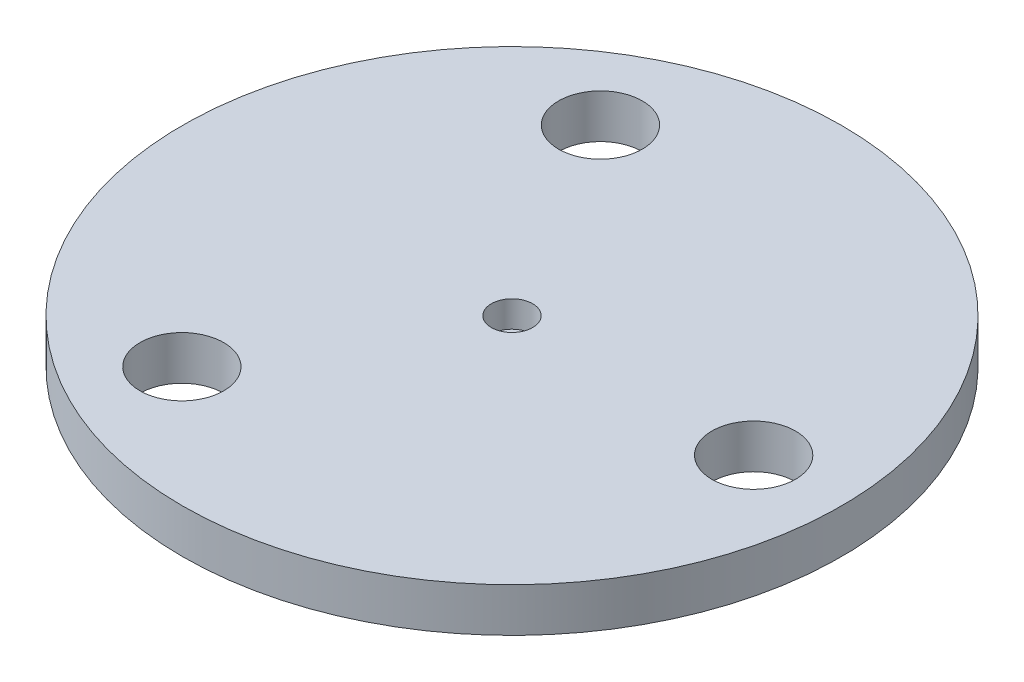
ISO-10303-21;
HEADER;
FILE_DESCRIPTION(('STEP AP214'),'2;1');
FILE_NAME('part.step','',(''),(''),'','','');
FILE_SCHEMA(('AUTOMOTIVE_DESIGN { 1 0 10303 214 1 1 1 1 }'));
ENDSEC;
DATA;
#1=APPLICATION_CONTEXT('core data for automotive mechanical design processes');
#2=APPLICATION_PROTOCOL_DEFINITION('international standard','automotive_design',2000,#1);
#3=PRODUCT_CONTEXT('',#1,'mechanical');
#4=PRODUCT('Part','Part','',(#3));
#5=PRODUCT_RELATED_PRODUCT_CATEGORY('part','',(#4));
#6=PRODUCT_DEFINITION_FORMATION('','',#4);
#7=PRODUCT_DEFINITION_CONTEXT('part definition',#1,'design');
#8=PRODUCT_DEFINITION('design','',#6,#7);
#9=PRODUCT_DEFINITION_SHAPE('','',#8);
#10=(LENGTH_UNIT() NAMED_UNIT(*) SI_UNIT(.MILLI.,.METRE.));
#11=(NAMED_UNIT(*) PLANE_ANGLE_UNIT() SI_UNIT($,.RADIAN.));
#12=(NAMED_UNIT(*) SI_UNIT($,.STERADIAN.) SOLID_ANGLE_UNIT());
#13=UNCERTAINTY_MEASURE_WITH_UNIT(LENGTH_MEASURE(1.E-05),#10,'distance_accuracy_value','');
#14=(GEOMETRIC_REPRESENTATION_CONTEXT(3) GLOBAL_UNCERTAINTY_ASSIGNED_CONTEXT((#13)) GLOBAL_UNIT_ASSIGNED_CONTEXT((#10,
#11,#12)) REPRESENTATION_CONTEXT('',''));
#15=CARTESIAN_POINT('',(0.,0.,0.));
#16=DIRECTION('',(0.,0.,1.));
#17=DIRECTION('',(1.,0.,0.));
#18=AXIS2_PLACEMENT_3D('',#15,#16,#17);
#19=CARTESIAN_POINT('',(0.,3.,0.));
#20=DIRECTION('',(0.,-1.,0.));
#21=DIRECTION('',(0.,0.,-1.));
#22=AXIS2_PLACEMENT_3D('',#19,#20,#21);
#23=CYLINDRICAL_SURFACE('',#22,2.35);
#24=CARTESIAN_POINT('',(0.,3.,0.));
#25=DIRECTION('',(0.,1.,0.));
#26=DIRECTION('',(0.,0.,1.));
#27=AXIS2_PLACEMENT_3D('',#24,#25,#26);
#28=CIRCLE('',#27,2.35);
#29=CARTESIAN_POINT('',(0.,3.,2.35));
#30=VERTEX_POINT('',#29);
#31=EDGE_CURVE('E40',#30,#30,#28,.T.);
#32=ORIENTED_EDGE('',*,*,#31,.T.);
#33=EDGE_LOOP('',(#32));
#34=FACE_BOUND('',#33,.T.);
#35=CARTESIAN_POINT('',(0.,0.,0.));
#36=DIRECTION('',(0.,1.,0.));
#37=DIRECTION('',(0.,0.,1.));
#38=AXIS2_PLACEMENT_3D('',#35,#36,#37);
#39=CIRCLE('',#38,2.35);
#40=CARTESIAN_POINT('',(0.,0.,2.35));
#41=VERTEX_POINT('',#40);
#42=EDGE_CURVE('E36',#41,#41,#39,.T.);
#43=ORIENTED_EDGE('',*,*,#42,.F.);
#44=EDGE_LOOP('',(#43));
#45=FACE_BOUND('',#44,.T.);
#46=ADVANCED_FACE('F33',(#34,#45),#23,.F.);
#47=CARTESIAN_POINT('',(0.,3.,0.));
#48=DIRECTION('',(0.,-1.,0.));
#49=DIRECTION('',(0.,0.,-1.));
#50=AXIS2_PLACEMENT_3D('',#47,#48,#49);
#51=CYLINDRICAL_SURFACE('',#50,37.5);
#52=CARTESIAN_POINT('',(0.,3.,0.));
#53=DIRECTION('',(0.,1.,0.));
#54=DIRECTION('',(0.,0.,1.));
#55=AXIS2_PLACEMENT_3D('',#52,#53,#54);
#56=CIRCLE('',#55,37.5);
#57=CARTESIAN_POINT('',(0.,3.,37.5));
#58=VERTEX_POINT('',#57);
#59=EDGE_CURVE('E10',#58,#58,#56,.T.);
#60=ORIENTED_EDGE('',*,*,#59,.F.);
#61=EDGE_LOOP('',(#60));
#62=FACE_BOUND('',#61,.T.);
#63=CARTESIAN_POINT('',(0.,-2.,0.));
#64=DIRECTION('',(0.,1.,0.));
#65=DIRECTION('',(0.,0.,1.));
#66=AXIS2_PLACEMENT_3D('',#63,#64,#65);
#67=CIRCLE('',#66,37.5);
#68=CARTESIAN_POINT('',(0.,-2.,37.5));
#69=VERTEX_POINT('',#68);
#70=EDGE_CURVE('E46',#69,#69,#67,.T.);
#71=ORIENTED_EDGE('',*,*,#70,.T.);
#72=EDGE_LOOP('',(#71));
#73=FACE_BOUND('',#72,.T.);
#74=ADVANCED_FACE('F82',(#62,#73),#51,.T.);
#75=CARTESIAN_POINT('',(0.,3.,0.));
#76=DIRECTION('',(0.,1.,0.));
#77=DIRECTION('',(0.,0.,1.));
#78=AXIS2_PLACEMENT_3D('',#75,#76,#77);
#79=PLANE('',#78);
#80=CARTESIAN_POINT('',(-13.7500000000001,3.,-23.815698604072));
#81=DIRECTION('',(0.,1.,0.));
#82=DIRECTION('',(0.866025403784436,0.,-0.500000000000004));
#83=AXIS2_PLACEMENT_3D('',#80,#81,#82);
#84=CIRCLE('',#83,4.7625);
#85=CARTESIAN_POINT('',(-9.62555401447673,3.,-26.196948604072));
#86=VERTEX_POINT('',#85);
#87=EDGE_CURVE('E62',#86,#86,#84,.T.);
#88=ORIENTED_EDGE('',*,*,#87,.F.);
#89=EDGE_LOOP('',(#88));
#90=FACE_BOUND('',#89,.T.);
#91=CARTESIAN_POINT('',(-13.7499999999998,3.,23.8156986040722));
#92=DIRECTION('',(0.,1.,0.));
#93=DIRECTION('',(-0.866025403784443,0.,-0.499999999999992));
#94=AXIS2_PLACEMENT_3D('',#91,#92,#93);
#95=CIRCLE('',#94,4.7625);
#96=CARTESIAN_POINT('',(-17.8744459855232,3.,21.4344486040722));
#97=VERTEX_POINT('',#96);
#98=EDGE_CURVE('E56',#97,#97,#95,.T.);
#99=ORIENTED_EDGE('',*,*,#98,.F.);
#100=EDGE_LOOP('',(#99));
#101=FACE_BOUND('',#100,.T.);
#102=CARTESIAN_POINT('',(27.5,3.,0.));
#103=DIRECTION('',(0.,1.,0.));
#104=DIRECTION('',(0.,0.,1.));
#105=AXIS2_PLACEMENT_3D('',#102,#103,#104);
#106=CIRCLE('',#105,4.7625);
#107=CARTESIAN_POINT('',(27.5,3.,4.7625));
#108=VERTEX_POINT('',#107);
#109=EDGE_CURVE('E50',#108,#108,#106,.T.);
#110=ORIENTED_EDGE('',*,*,#109,.F.);
#111=EDGE_LOOP('',(#110));
#112=FACE_BOUND('',#111,.T.);
#113=ORIENTED_EDGE('',*,*,#31,.F.);
#114=EDGE_LOOP('',(#113));
#115=FACE_BOUND('',#114,.T.);
#116=ORIENTED_EDGE('',*,*,#59,.T.);
#117=EDGE_LOOP('',(#116));
#118=FACE_BOUND('',#117,.T.);
#119=ADVANCED_FACE('F78',(#90,#101,#112,#115,#118),#79,.T.);
#120=CARTESIAN_POINT('',(0.,0.,0.));
#121=DIRECTION('',(0.,1.,0.));
#122=DIRECTION('',(0.,0.,1.));
#123=AXIS2_PLACEMENT_3D('',#120,#121,#122);
#124=PLANE('',#123);
#125=ORIENTED_EDGE('',*,*,#42,.T.);
#126=EDGE_LOOP('',(#125));
#127=FACE_BOUND('',#126,.T.);
#128=ADVANCED_FACE('F81',(#127),#124,.T.);
#129=CARTESIAN_POINT('',(0.,-2.,0.));
#130=DIRECTION('',(0.,1.,0.));
#131=DIRECTION('',(0.,0.,1.));
#132=AXIS2_PLACEMENT_3D('',#129,#130,#131);
#133=PLANE('',#132);
#134=CARTESIAN_POINT('',(-13.7500000000001,-2.,-23.815698604072));
#135=DIRECTION('',(0.,1.,0.));
#136=DIRECTION('',(0.866025403784436,0.,-0.500000000000004));
#137=AXIS2_PLACEMENT_3D('',#134,#135,#136);
#138=CIRCLE('',#137,4.7625);
#139=CARTESIAN_POINT('',(-9.62555401447673,-2.,-26.196948604072));
#140=VERTEX_POINT('',#139);
#141=EDGE_CURVE('E53',#140,#140,#138,.T.);
#142=ORIENTED_EDGE('',*,*,#141,.T.);
#143=EDGE_LOOP('',(#142));
#144=FACE_BOUND('',#143,.T.);
#145=CARTESIAN_POINT('',(-13.7499999999998,-2.,23.8156986040722));
#146=DIRECTION('',(0.,1.,0.));
#147=DIRECTION('',(-0.866025403784443,0.,-0.499999999999992));
#148=AXIS2_PLACEMENT_3D('',#145,#146,#147);
#149=CIRCLE('',#148,4.7625);
#150=CARTESIAN_POINT('',(-17.8744459855232,-2.,21.4344486040722));
#151=VERTEX_POINT('',#150);
#152=EDGE_CURVE('E59',#151,#151,#149,.T.);
#153=ORIENTED_EDGE('',*,*,#152,.T.);
#154=EDGE_LOOP('',(#153));
#155=FACE_BOUND('',#154,.T.);
#156=CARTESIAN_POINT('',(27.5,-2.,0.));
#157=DIRECTION('',(0.,1.,0.));
#158=DIRECTION('',(0.,0.,1.));
#159=AXIS2_PLACEMENT_3D('',#156,#157,#158);
#160=CIRCLE('',#159,4.7625);
#161=CARTESIAN_POINT('',(27.5,-2.,4.7625));
#162=VERTEX_POINT('',#161);
#163=EDGE_CURVE('E49',#162,#162,#160,.T.);
#164=ORIENTED_EDGE('',*,*,#163,.T.);
#165=EDGE_LOOP('',(#164));
#166=FACE_BOUND('',#165,.T.);
#167=ORIENTED_EDGE('',*,*,#70,.F.);
#168=EDGE_LOOP('',(#167));
#169=FACE_BOUND('',#168,.T.);
#170=ADVANCED_FACE('F68',(#144,#155,#166,#169),#133,.F.);
#171=CARTESIAN_POINT('',(27.5,-2.,0.));
#172=DIRECTION('',(0.,1.,0.));
#173=DIRECTION('',(0.,0.,1.));
#174=AXIS2_PLACEMENT_3D('',#171,#172,#173);
#175=CYLINDRICAL_SURFACE('',#174,4.7625);
#176=ORIENTED_EDGE('',*,*,#163,.F.);
#177=EDGE_LOOP('',(#176));
#178=FACE_BOUND('',#177,.T.);
#179=ORIENTED_EDGE('',*,*,#109,.T.);
#180=EDGE_LOOP('',(#179));
#181=FACE_BOUND('',#180,.T.);
#182=ADVANCED_FACE('F100',(#178,#181),#175,.F.);
#183=CARTESIAN_POINT('',(-13.7499999999998,-2.,23.8156986040722));
#184=DIRECTION('',(0.,1.,0.));
#185=DIRECTION('',(0.,0.,1.));
#186=AXIS2_PLACEMENT_3D('',#183,#184,#185);
#187=CYLINDRICAL_SURFACE('',#186,4.7625);
#188=ORIENTED_EDGE('',*,*,#152,.F.);
#189=EDGE_LOOP('',(#188));
#190=FACE_BOUND('',#189,.T.);
#191=ORIENTED_EDGE('',*,*,#98,.T.);
#192=EDGE_LOOP('',(#191));
#193=FACE_BOUND('',#192,.T.);
#194=ADVANCED_FACE('F74',(#190,#193),#187,.F.);
#195=CARTESIAN_POINT('',(-13.7500000000001,-2.,-23.815698604072));
#196=DIRECTION('',(0.,1.,0.));
#197=DIRECTION('',(0.,0.,1.));
#198=AXIS2_PLACEMENT_3D('',#195,#196,#197);
#199=CYLINDRICAL_SURFACE('',#198,4.7625);
#200=ORIENTED_EDGE('',*,*,#141,.F.);
#201=EDGE_LOOP('',(#200));
#202=FACE_BOUND('',#201,.T.);
#203=ORIENTED_EDGE('',*,*,#87,.T.);
#204=EDGE_LOOP('',(#203));
#205=FACE_BOUND('',#204,.T.);
#206=ADVANCED_FACE('F71',(#202,#205),#199,.F.);
#207=CLOSED_SHELL('',(#46,#74,#119,#128,#170,#182,#194,#206));
#208=MANIFOLD_SOLID_BREP('B2',#207);
#209=ADVANCED_BREP_SHAPE_REPRESENTATION('',(#18,#208),#14);
#210=SHAPE_DEFINITION_REPRESENTATION(#9,#209);
ENDSEC;
END-ISO-10303-21;
